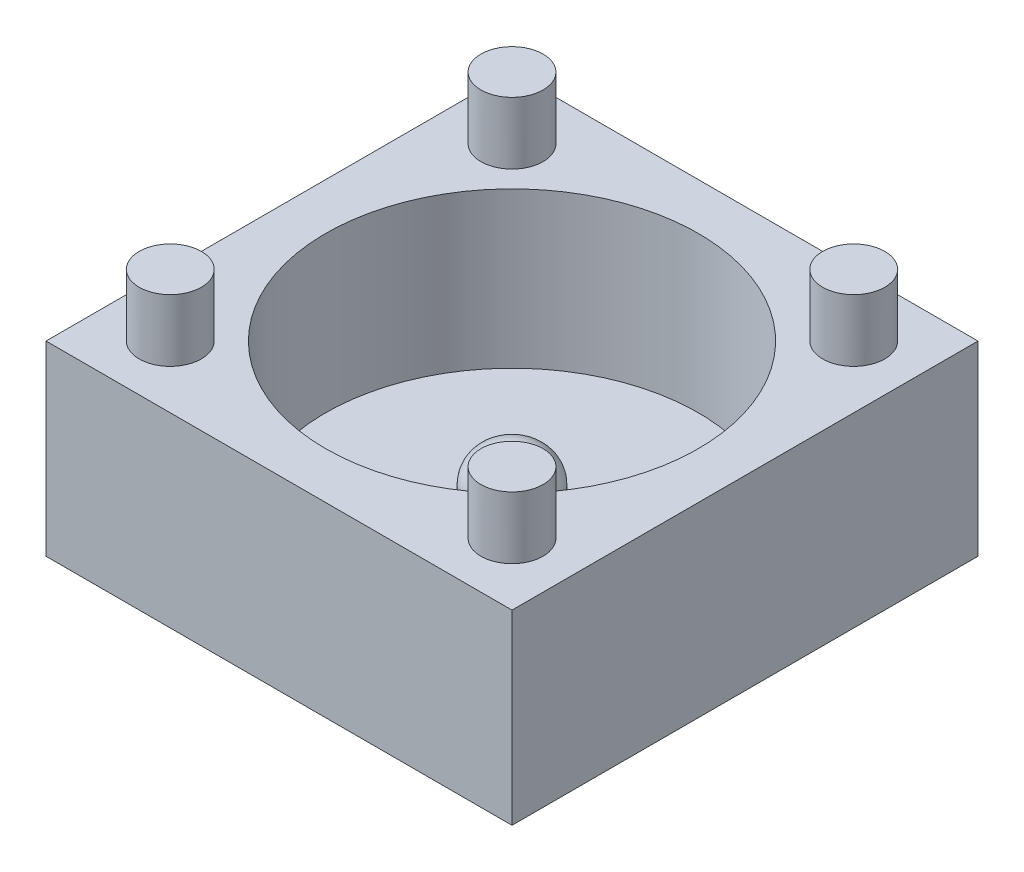
ISO-10303-21;
HEADER;
FILE_DESCRIPTION(('STEP AP214'),'2;1');
FILE_NAME('part.step','',(''),(''),'','','');
FILE_SCHEMA(('AUTOMOTIVE_DESIGN { 1 0 10303 214 1 1 1 1 }'));
ENDSEC;
DATA;
#1=APPLICATION_CONTEXT('core data for automotive mechanical design processes');
#2=APPLICATION_PROTOCOL_DEFINITION('international standard','automotive_design',2000,#1);
#3=PRODUCT_CONTEXT('',#1,'mechanical');
#4=PRODUCT('Part','Part','',(#3));
#5=PRODUCT_RELATED_PRODUCT_CATEGORY('part','',(#4));
#6=PRODUCT_DEFINITION_FORMATION('','',#4);
#7=PRODUCT_DEFINITION_CONTEXT('part definition',#1,'design');
#8=PRODUCT_DEFINITION('design','',#6,#7);
#9=PRODUCT_DEFINITION_SHAPE('','',#8);
#10=(LENGTH_UNIT() NAMED_UNIT(*) SI_UNIT(.MILLI.,.METRE.));
#11=(NAMED_UNIT(*) PLANE_ANGLE_UNIT() SI_UNIT($,.RADIAN.));
#12=(NAMED_UNIT(*) SI_UNIT($,.STERADIAN.) SOLID_ANGLE_UNIT());
#13=UNCERTAINTY_MEASURE_WITH_UNIT(LENGTH_MEASURE(1.E-05),#10,'distance_accuracy_value','');
#14=(GEOMETRIC_REPRESENTATION_CONTEXT(3) GLOBAL_UNCERTAINTY_ASSIGNED_CONTEXT((#13)) GLOBAL_UNIT_ASSIGNED_CONTEXT((#10,
#11,#12)) REPRESENTATION_CONTEXT('',''));
#15=CARTESIAN_POINT('',(0.,0.,0.));
#16=DIRECTION('',(0.,0.,1.));
#17=DIRECTION('',(1.,0.,0.));
#18=AXIS2_PLACEMENT_3D('',#15,#16,#17);
#19=CARTESIAN_POINT('',(7.5,6.,7.5));
#20=DIRECTION('',(-1.,0.,0.));
#21=DIRECTION('',(0.,0.,1.));
#22=AXIS2_PLACEMENT_3D('',#19,#20,#21);
#23=PLANE('',#22);
#24=DIRECTION('',(0.,0.,-1.));
#25=VECTOR('',#24,1.);
#26=CARTESIAN_POINT('',(7.5,0.,7.5));
#27=LINE('',#26,#25);
#28=CARTESIAN_POINT('',(7.5,0.,7.5));
#29=VERTEX_POINT('',#28);
#30=CARTESIAN_POINT('',(7.5,0.,-7.5));
#31=VERTEX_POINT('',#30);
#32=EDGE_CURVE('E101',#29,#31,#27,.T.);
#33=ORIENTED_EDGE('',*,*,#32,.T.);
#34=DIRECTION('',(0.,-1.,0.));
#35=VECTOR('',#34,1.);
#36=CARTESIAN_POINT('',(7.5,6.,-7.5));
#37=LINE('',#36,#35);
#38=CARTESIAN_POINT('',(7.5,6.,-7.5));
#39=VERTEX_POINT('',#38);
#40=EDGE_CURVE('E92',#39,#31,#37,.T.);
#41=ORIENTED_EDGE('',*,*,#40,.F.);
#42=DIRECTION('',(0.,0.,-1.));
#43=VECTOR('',#42,1.);
#44=CARTESIAN_POINT('',(7.5,6.,7.5));
#45=LINE('',#44,#43);
#46=CARTESIAN_POINT('',(7.5,6.,7.5));
#47=VERTEX_POINT('',#46);
#48=EDGE_CURVE('E86',#47,#39,#45,.T.);
#49=ORIENTED_EDGE('',*,*,#48,.F.);
#50=DIRECTION('',(0.,-1.,0.));
#51=VECTOR('',#50,1.);
#52=CARTESIAN_POINT('',(7.5,6.,7.5));
#53=LINE('',#52,#51);
#54=EDGE_CURVE('E97',#47,#29,#53,.T.);
#55=ORIENTED_EDGE('',*,*,#54,.T.);
#56=EDGE_LOOP('',(#33,#41,#49,#55));
#57=FACE_BOUND('',#56,.T.);
#58=ADVANCED_FACE('F33',(#57),#23,.F.);
#59=CARTESIAN_POINT('',(-7.5,6.,-7.5));
#60=DIRECTION('',(0.,0.,1.));
#61=DIRECTION('',(1.,0.,0.));
#62=AXIS2_PLACEMENT_3D('',#59,#60,#61);
#63=PLANE('',#62);
#64=DIRECTION('',(-1.,0.,0.));
#65=VECTOR('',#64,1.);
#66=CARTESIAN_POINT('',(-7.5,0.,-7.5));
#67=LINE('',#66,#65);
#68=CARTESIAN_POINT('',(-7.5,0.,-7.5));
#69=VERTEX_POINT('',#68);
#70=EDGE_CURVE('E91',#31,#69,#67,.T.);
#71=ORIENTED_EDGE('',*,*,#70,.T.);
#72=DIRECTION('',(0.,-1.,0.));
#73=VECTOR('',#72,1.);
#74=CARTESIAN_POINT('',(-7.5,6.,-7.5));
#75=LINE('',#74,#73);
#76=CARTESIAN_POINT('',(-7.5,6.,-7.5));
#77=VERTEX_POINT('',#76);
#78=EDGE_CURVE('E89',#77,#69,#75,.T.);
#79=ORIENTED_EDGE('',*,*,#78,.F.);
#80=DIRECTION('',(-1.,0.,0.));
#81=VECTOR('',#80,1.);
#82=CARTESIAN_POINT('',(-7.5,6.,-7.5));
#83=LINE('',#82,#81);
#84=EDGE_CURVE('E81',#39,#77,#83,.T.);
#85=ORIENTED_EDGE('',*,*,#84,.F.);
#86=ORIENTED_EDGE('',*,*,#40,.T.);
#87=EDGE_LOOP('',(#71,#79,#85,#86));
#88=FACE_BOUND('',#87,.T.);
#89=ADVANCED_FACE('F90',(#88),#63,.F.);
#90=CARTESIAN_POINT('',(-7.5,6.,7.5));
#91=DIRECTION('',(1.,0.,0.));
#92=DIRECTION('',(0.,0.,-1.));
#93=AXIS2_PLACEMENT_3D('',#90,#91,#92);
#94=PLANE('',#93);
#95=DIRECTION('',(0.,0.,1.));
#96=VECTOR('',#95,1.);
#97=CARTESIAN_POINT('',(-7.5,0.,7.5));
#98=LINE('',#97,#96);
#99=CARTESIAN_POINT('',(-7.5,0.,7.5));
#100=VERTEX_POINT('',#99);
#101=EDGE_CURVE('E67',#69,#100,#98,.T.);
#102=ORIENTED_EDGE('',*,*,#101,.T.);
#103=DIRECTION('',(0.,-1.,0.));
#104=VECTOR('',#103,1.);
#105=CARTESIAN_POINT('',(-7.5,6.,7.5));
#106=LINE('',#105,#104);
#107=CARTESIAN_POINT('',(-7.5,6.,7.5));
#108=VERTEX_POINT('',#107);
#109=EDGE_CURVE('E93',#108,#100,#106,.T.);
#110=ORIENTED_EDGE('',*,*,#109,.F.);
#111=DIRECTION('',(0.,0.,1.));
#112=VECTOR('',#111,1.);
#113=CARTESIAN_POINT('',(-7.5,6.,7.5));
#114=LINE('',#113,#112);
#115=EDGE_CURVE('E84',#77,#108,#114,.T.);
#116=ORIENTED_EDGE('',*,*,#115,.F.);
#117=ORIENTED_EDGE('',*,*,#78,.T.);
#118=EDGE_LOOP('',(#102,#110,#116,#117));
#119=FACE_BOUND('',#118,.T.);
#120=ADVANCED_FACE('F95',(#119),#94,.F.);
#121=CARTESIAN_POINT('',(-7.5,6.,7.5));
#122=DIRECTION('',(0.,0.,-1.));
#123=DIRECTION('',(-1.,0.,0.));
#124=AXIS2_PLACEMENT_3D('',#121,#122,#123);
#125=PLANE('',#124);
#126=DIRECTION('',(1.,0.,0.));
#127=VECTOR('',#126,1.);
#128=CARTESIAN_POINT('',(-7.5,0.,7.5));
#129=LINE('',#128,#127);
#130=EDGE_CURVE('E73',#100,#29,#129,.T.);
#131=ORIENTED_EDGE('',*,*,#130,.T.);
#132=ORIENTED_EDGE('',*,*,#54,.F.);
#133=DIRECTION('',(1.,0.,0.));
#134=VECTOR('',#133,1.);
#135=CARTESIAN_POINT('',(-7.5,6.,7.5));
#136=LINE('',#135,#134);
#137=EDGE_CURVE('E50',#108,#47,#136,.T.);
#138=ORIENTED_EDGE('',*,*,#137,.F.);
#139=ORIENTED_EDGE('',*,*,#109,.T.);
#140=EDGE_LOOP('',(#131,#132,#138,#139));
#141=FACE_BOUND('',#140,.T.);
#142=ADVANCED_FACE('F130',(#141),#125,.F.);
#143=CARTESIAN_POINT('',(0.,6.,0.));
#144=DIRECTION('',(0.,-1.,0.));
#145=DIRECTION('',(0.,0.,-1.));
#146=AXIS2_PLACEMENT_3D('',#143,#144,#145);
#147=PLANE('',#146);
#148=CARTESIAN_POINT('',(5.5,6.,5.5));
#149=DIRECTION('',(0.,-1.,0.));
#150=DIRECTION('',(0.,0.,-1.));
#151=AXIS2_PLACEMENT_3D('',#148,#149,#150);
#152=CIRCLE('',#151,1.);
#153=CARTESIAN_POINT('',(5.5,6.,4.5));
#154=VERTEX_POINT('',#153);
#155=EDGE_CURVE('E11',#154,#154,#152,.F.);
#156=ORIENTED_EDGE('',*,*,#155,.F.);
#157=EDGE_LOOP('',(#156));
#158=FACE_BOUND('',#157,.T.);
#159=CARTESIAN_POINT('',(-5.5,6.,5.5));
#160=DIRECTION('',(0.,-1.,0.));
#161=DIRECTION('',(0.,0.,-1.));
#162=AXIS2_PLACEMENT_3D('',#159,#160,#161);
#163=CIRCLE('',#162,1.);
#164=CARTESIAN_POINT('',(-5.5,6.,4.5));
#165=VERTEX_POINT('',#164);
#166=EDGE_CURVE('E42',#165,#165,#163,.F.);
#167=ORIENTED_EDGE('',*,*,#166,.F.);
#168=EDGE_LOOP('',(#167));
#169=FACE_BOUND('',#168,.T.);
#170=CARTESIAN_POINT('',(5.5,6.,-5.5));
#171=DIRECTION('',(0.,-1.,0.));
#172=DIRECTION('',(0.,0.,-1.));
#173=AXIS2_PLACEMENT_3D('',#170,#171,#172);
#174=CIRCLE('',#173,1.);
#175=CARTESIAN_POINT('',(5.5,6.,-6.5));
#176=VERTEX_POINT('',#175);
#177=EDGE_CURVE('E120',#176,#176,#174,.F.);
#178=ORIENTED_EDGE('',*,*,#177,.F.);
#179=EDGE_LOOP('',(#178));
#180=FACE_BOUND('',#179,.T.);
#181=CARTESIAN_POINT('',(-5.5,6.,-5.5));
#182=DIRECTION('',(0.,-1.,0.));
#183=DIRECTION('',(0.,0.,-1.));
#184=AXIS2_PLACEMENT_3D('',#181,#182,#183);
#185=CIRCLE('',#184,1.);
#186=CARTESIAN_POINT('',(-5.5,6.,-6.5));
#187=VERTEX_POINT('',#186);
#188=EDGE_CURVE('E117',#187,#187,#185,.F.);
#189=ORIENTED_EDGE('',*,*,#188,.F.);
#190=EDGE_LOOP('',(#189));
#191=FACE_BOUND('',#190,.T.);
#192=CARTESIAN_POINT('',(0.,6.,0.));
#193=DIRECTION('',(0.,1.,0.));
#194=DIRECTION('',(0.,0.,1.));
#195=AXIS2_PLACEMENT_3D('',#192,#193,#194);
#196=CIRCLE('',#195,6.);
#197=CARTESIAN_POINT('',(0.,6.,6.));
#198=VERTEX_POINT('',#197);
#199=EDGE_CURVE('E139',#198,#198,#196,.T.);
#200=ORIENTED_EDGE('',*,*,#199,.F.);
#201=EDGE_LOOP('',(#200));
#202=FACE_BOUND('',#201,.T.);
#203=ORIENTED_EDGE('',*,*,#48,.T.);
#204=ORIENTED_EDGE('',*,*,#84,.T.);
#205=ORIENTED_EDGE('',*,*,#115,.T.);
#206=ORIENTED_EDGE('',*,*,#137,.T.);
#207=EDGE_LOOP('',(#203,#204,#205,#206));
#208=FACE_BOUND('',#207,.T.);
#209=ADVANCED_FACE('F82',(#158,#169,#180,#191,#202,#208),#147,.F.);
#210=CARTESIAN_POINT('',(0.,0.,0.));
#211=DIRECTION('',(0.,-1.,0.));
#212=DIRECTION('',(0.,0.,-1.));
#213=AXIS2_PLACEMENT_3D('',#210,#211,#212);
#214=PLANE('',#213);
#215=ORIENTED_EDGE('',*,*,#32,.F.);
#216=ORIENTED_EDGE('',*,*,#130,.F.);
#217=ORIENTED_EDGE('',*,*,#101,.F.);
#218=ORIENTED_EDGE('',*,*,#70,.F.);
#219=EDGE_LOOP('',(#215,#216,#217,#218));
#220=FACE_BOUND('',#219,.T.);
#221=ADVANCED_FACE('F129',(#220),#214,.T.);
#222=CARTESIAN_POINT('',(0.,1.,0.));
#223=DIRECTION('',(0.,1.,0.));
#224=DIRECTION('',(0.,0.,1.));
#225=AXIS2_PLACEMENT_3D('',#222,#223,#224);
#226=CYLINDRICAL_SURFACE('',#225,6.);
#227=CARTESIAN_POINT('',(0.,1.,0.));
#228=DIRECTION('',(0.,1.,0.));
#229=DIRECTION('',(0.,0.,1.));
#230=AXIS2_PLACEMENT_3D('',#227,#228,#229);
#231=CIRCLE('',#230,6.);
#232=CARTESIAN_POINT('',(0.,1.,6.));
#233=VERTEX_POINT('',#232);
#234=EDGE_CURVE('E104',#233,#233,#231,.T.);
#235=ORIENTED_EDGE('',*,*,#234,.F.);
#236=EDGE_LOOP('',(#235));
#237=FACE_BOUND('',#236,.T.);
#238=ORIENTED_EDGE('',*,*,#199,.T.);
#239=EDGE_LOOP('',(#238));
#240=FACE_BOUND('',#239,.T.);
#241=ADVANCED_FACE('F188',(#237,#240),#226,.F.);
#242=CARTESIAN_POINT('',(0.,1.,0.));
#243=DIRECTION('',(0.,1.,0.));
#244=DIRECTION('',(0.,0.,1.));
#245=AXIS2_PLACEMENT_3D('',#242,#243,#244);
#246=PLANE('',#245);
#247=CARTESIAN_POINT('',(0.,1.,0.));
#248=DIRECTION('',(0.,1.,0.));
#249=DIRECTION('',(0.,0.,1.));
#250=AXIS2_PLACEMENT_3D('',#247,#248,#249);
#251=CIRCLE('',#250,1.25);
#252=CARTESIAN_POINT('',(0.,1.,1.25));
#253=VERTEX_POINT('',#252);
#254=EDGE_CURVE('E141',#253,#253,#251,.T.);
#255=ORIENTED_EDGE('',*,*,#254,.F.);
#256=EDGE_LOOP('',(#255));
#257=FACE_BOUND('',#256,.T.);
#258=ORIENTED_EDGE('',*,*,#234,.T.);
#259=EDGE_LOOP('',(#258));
#260=FACE_BOUND('',#259,.T.);
#261=ADVANCED_FACE('F193',(#257,#260),#246,.T.);
#262=CARTESIAN_POINT('',(0.,3.,0.));
#263=DIRECTION('',(0.,-1.,0.));
#264=DIRECTION('',(0.,0.,-1.));
#265=AXIS2_PLACEMENT_3D('',#262,#263,#264);
#266=CYLINDRICAL_SURFACE('',#265,1.25);
#267=CARTESIAN_POINT('',(0.,2.,0.));
#268=DIRECTION('',(0.,1.,0.));
#269=DIRECTION('',(0.,0.,1.));
#270=AXIS2_PLACEMENT_3D('',#267,#268,#269);
#271=CIRCLE('',#270,1.25);
#272=CARTESIAN_POINT('',(0.,2.,1.25));
#273=VERTEX_POINT('',#272);
#274=EDGE_CURVE('E114',#273,#273,#271,.F.);
#275=ORIENTED_EDGE('',*,*,#274,.T.);
#276=EDGE_LOOP('',(#275));
#277=FACE_BOUND('',#276,.T.);
#278=ORIENTED_EDGE('',*,*,#254,.T.);
#279=EDGE_LOOP('',(#278));
#280=FACE_BOUND('',#279,.T.);
#281=ADVANCED_FACE('F197',(#277,#280),#266,.T.);
#282=CARTESIAN_POINT('',(0.,3.,0.));
#283=DIRECTION('',(0.,1.,0.));
#284=DIRECTION('',(0.,0.,1.));
#285=AXIS2_PLACEMENT_3D('',#282,#283,#284);
#286=PLANE('',#285);
#287=CARTESIAN_POINT('',(0.,3.,0.));
#288=DIRECTION('',(0.,1.,0.));
#289=DIRECTION('',(0.,0.,1.));
#290=AXIS2_PLACEMENT_3D('',#287,#288,#289);
#291=CIRCLE('',#290,0.25);
#292=CARTESIAN_POINT('',(0.,3.,0.25));
#293=VERTEX_POINT('',#292);
#294=EDGE_CURVE('E111',#293,#293,#291,.T.);
#295=ORIENTED_EDGE('',*,*,#294,.T.);
#296=EDGE_LOOP('',(#295));
#297=FACE_BOUND('',#296,.T.);
#298=ADVANCED_FACE('F201',(#297),#286,.T.);
#299=CARTESIAN_POINT('',(0.,2.,0.));
#300=DIRECTION('',(0.,1.,0.));
#301=DIRECTION('',(0.,0.,1.));
#302=AXIS2_PLACEMENT_3D('',#299,#300,#301);
#303=DEGENERATE_TOROIDAL_SURFACE('',#302,0.25,1.,.T.);
#304=ORIENTED_EDGE('',*,*,#274,.F.);
#305=EDGE_LOOP('',(#304));
#306=FACE_BOUND('',#305,.T.);
#307=ORIENTED_EDGE('',*,*,#294,.F.);
#308=EDGE_LOOP('',(#307));
#309=FACE_BOUND('',#308,.T.);
#310=ADVANCED_FACE('F35',(#306,#309),#303,.T.);
#311=CARTESIAN_POINT('',(-5.5,8.,-5.5));
#312=DIRECTION('',(0.,-1.,0.));
#313=DIRECTION('',(0.,0.,-1.));
#314=AXIS2_PLACEMENT_3D('',#311,#312,#313);
#315=CYLINDRICAL_SURFACE('',#314,1.);
#316=CARTESIAN_POINT('',(-5.5,8.,-5.5));
#317=DIRECTION('',(0.,1.,0.));
#318=DIRECTION('',(0.,0.,1.));
#319=AXIS2_PLACEMENT_3D('',#316,#317,#318);
#320=CIRCLE('',#319,1.);
#321=CARTESIAN_POINT('',(-5.5,8.,-4.5));
#322=VERTEX_POINT('',#321);
#323=EDGE_CURVE('E146',#322,#322,#320,.T.);
#324=ORIENTED_EDGE('',*,*,#323,.F.);
#325=EDGE_LOOP('',(#324));
#326=FACE_BOUND('',#325,.T.);
#327=ORIENTED_EDGE('',*,*,#188,.T.);
#328=EDGE_LOOP('',(#327));
#329=FACE_BOUND('',#328,.T.);
#330=ADVANCED_FACE('F206',(#326,#329),#315,.T.);
#331=CARTESIAN_POINT('',(-5.5,8.,-5.5));
#332=DIRECTION('',(0.,1.,0.));
#333=DIRECTION('',(0.,0.,1.));
#334=AXIS2_PLACEMENT_3D('',#331,#332,#333);
#335=PLANE('',#334);
#336=ORIENTED_EDGE('',*,*,#323,.T.);
#337=EDGE_LOOP('',(#336));
#338=FACE_BOUND('',#337,.T.);
#339=ADVANCED_FACE('F209',(#338),#335,.T.);
#340=CARTESIAN_POINT('',(5.5,8.,-5.5));
#341=DIRECTION('',(0.,-1.,0.));
#342=DIRECTION('',(0.,0.,-1.));
#343=AXIS2_PLACEMENT_3D('',#340,#341,#342);
#344=CYLINDRICAL_SURFACE('',#343,1.);
#345=CARTESIAN_POINT('',(5.5,8.,-5.5));
#346=DIRECTION('',(0.,1.,0.));
#347=DIRECTION('',(0.,0.,1.));
#348=AXIS2_PLACEMENT_3D('',#345,#346,#347);
#349=CIRCLE('',#348,1.);
#350=CARTESIAN_POINT('',(5.5,8.,-4.5));
#351=VERTEX_POINT('',#350);
#352=EDGE_CURVE('E151',#351,#351,#349,.T.);
#353=ORIENTED_EDGE('',*,*,#352,.F.);
#354=EDGE_LOOP('',(#353));
#355=FACE_BOUND('',#354,.T.);
#356=ORIENTED_EDGE('',*,*,#177,.T.);
#357=EDGE_LOOP('',(#356));
#358=FACE_BOUND('',#357,.T.);
#359=ADVANCED_FACE('F213',(#355,#358),#344,.T.);
#360=CARTESIAN_POINT('',(5.5,8.,-5.5));
#361=DIRECTION('',(0.,1.,0.));
#362=DIRECTION('',(0.,0.,1.));
#363=AXIS2_PLACEMENT_3D('',#360,#361,#362);
#364=PLANE('',#363);
#365=ORIENTED_EDGE('',*,*,#352,.T.);
#366=EDGE_LOOP('',(#365));
#367=FACE_BOUND('',#366,.T.);
#368=ADVANCED_FACE('F217',(#367),#364,.T.);
#369=CARTESIAN_POINT('',(-5.5,8.,5.5));
#370=DIRECTION('',(0.,-1.,0.));
#371=DIRECTION('',(0.,0.,-1.));
#372=AXIS2_PLACEMENT_3D('',#369,#370,#371);
#373=CYLINDRICAL_SURFACE('',#372,1.);
#374=CARTESIAN_POINT('',(-5.5,8.,5.5));
#375=DIRECTION('',(0.,1.,0.));
#376=DIRECTION('',(0.,0.,1.));
#377=AXIS2_PLACEMENT_3D('',#374,#375,#376);
#378=CIRCLE('',#377,1.);
#379=CARTESIAN_POINT('',(-5.5,8.,6.5));
#380=VERTEX_POINT('',#379);
#381=EDGE_CURVE('E154',#380,#380,#378,.T.);
#382=ORIENTED_EDGE('',*,*,#381,.F.);
#383=EDGE_LOOP('',(#382));
#384=FACE_BOUND('',#383,.T.);
#385=ORIENTED_EDGE('',*,*,#166,.T.);
#386=EDGE_LOOP('',(#385));
#387=FACE_BOUND('',#386,.T.);
#388=ADVANCED_FACE('F125',(#384,#387),#373,.T.);
#389=CARTESIAN_POINT('',(-5.5,8.,5.5));
#390=DIRECTION('',(0.,1.,0.));
#391=DIRECTION('',(0.,0.,1.));
#392=AXIS2_PLACEMENT_3D('',#389,#390,#391);
#393=PLANE('',#392);
#394=ORIENTED_EDGE('',*,*,#381,.T.);
#395=EDGE_LOOP('',(#394));
#396=FACE_BOUND('',#395,.T.);
#397=ADVANCED_FACE('F166',(#396),#393,.T.);
#398=CARTESIAN_POINT('',(5.5,8.,5.5));
#399=DIRECTION('',(0.,-1.,0.));
#400=DIRECTION('',(0.,0.,-1.));
#401=AXIS2_PLACEMENT_3D('',#398,#399,#400);
#402=CYLINDRICAL_SURFACE('',#401,1.);
#403=CARTESIAN_POINT('',(5.5,8.,5.5));
#404=DIRECTION('',(0.,1.,0.));
#405=DIRECTION('',(0.,0.,1.));
#406=AXIS2_PLACEMENT_3D('',#403,#404,#405);
#407=CIRCLE('',#406,1.);
#408=CARTESIAN_POINT('',(5.5,8.,6.5));
#409=VERTEX_POINT('',#408);
#410=EDGE_CURVE('E157',#409,#409,#407,.T.);
#411=ORIENTED_EDGE('',*,*,#410,.F.);
#412=EDGE_LOOP('',(#411));
#413=FACE_BOUND('',#412,.T.);
#414=ORIENTED_EDGE('',*,*,#155,.T.);
#415=EDGE_LOOP('',(#414));
#416=FACE_BOUND('',#415,.T.);
#417=ADVANCED_FACE('F163',(#413,#416),#402,.T.);
#418=CARTESIAN_POINT('',(5.5,8.,5.5));
#419=DIRECTION('',(0.,1.,0.));
#420=DIRECTION('',(0.,0.,1.));
#421=AXIS2_PLACEMENT_3D('',#418,#419,#420);
#422=PLANE('',#421);
#423=ORIENTED_EDGE('',*,*,#410,.T.);
#424=EDGE_LOOP('',(#423));
#425=FACE_BOUND('',#424,.T.);
#426=ADVANCED_FACE('F161',(#425),#422,.T.);
#427=CLOSED_SHELL('',(#58,#89,#120,#142,#209,#221,#241,#261,#281,#298,#310,#330,#339,#359,#368,
#388,#397,#417,#426));
#428=MANIFOLD_SOLID_BREP('B2',#427);
#429=ADVANCED_BREP_SHAPE_REPRESENTATION('',(#18,#428),#14);
#430=SHAPE_DEFINITION_REPRESENTATION(#9,#429);
ENDSEC;
END-ISO-10303-21;
